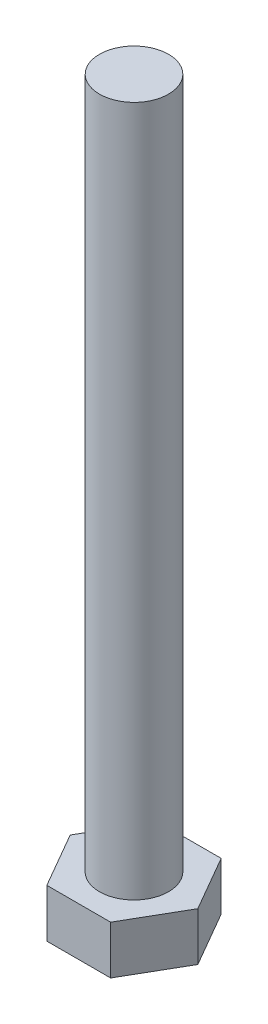
ISO-10303-21;
HEADER;
FILE_DESCRIPTION(('STEP AP214'),'2;1');
FILE_NAME('part.step','',(''),(''),'','','');
FILE_SCHEMA(('AUTOMOTIVE_DESIGN { 1 0 10303 214 1 1 1 1 }'));
ENDSEC;
DATA;
#1=APPLICATION_CONTEXT('core data for automotive mechanical design processes');
#2=APPLICATION_PROTOCOL_DEFINITION('international standard','automotive_design',2000,#1);
#3=PRODUCT_CONTEXT('',#1,'mechanical');
#4=PRODUCT('Part','Part','',(#3));
#5=PRODUCT_RELATED_PRODUCT_CATEGORY('part','',(#4));
#6=PRODUCT_DEFINITION_FORMATION('','',#4);
#7=PRODUCT_DEFINITION_CONTEXT('part definition',#1,'design');
#8=PRODUCT_DEFINITION('design','',#6,#7);
#9=PRODUCT_DEFINITION_SHAPE('','',#8);
#10=(LENGTH_UNIT() NAMED_UNIT(*) SI_UNIT(.MILLI.,.METRE.));
#11=(NAMED_UNIT(*) PLANE_ANGLE_UNIT() SI_UNIT($,.RADIAN.));
#12=(NAMED_UNIT(*) SI_UNIT($,.STERADIAN.) SOLID_ANGLE_UNIT());
#13=UNCERTAINTY_MEASURE_WITH_UNIT(LENGTH_MEASURE(1.E-05),#10,'distance_accuracy_value','');
#14=(GEOMETRIC_REPRESENTATION_CONTEXT(3) GLOBAL_UNCERTAINTY_ASSIGNED_CONTEXT((#13)) GLOBAL_UNIT_ASSIGNED_CONTEXT((#10,
#11,#12)) REPRESENTATION_CONTEXT('',''));
#15=CARTESIAN_POINT('',(0.,0.,0.));
#16=DIRECTION('',(0.,0.,1.));
#17=DIRECTION('',(1.,0.,0.));
#18=AXIS2_PLACEMENT_3D('',#15,#16,#17);
#19=CARTESIAN_POINT('',(0.,3.5,0.));
#20=DIRECTION('',(0.,1.,0.));
#21=DIRECTION('',(0.,0.,1.));
#22=AXIS2_PLACEMENT_3D('',#19,#20,#21);
#23=PLANE('',#22);
#24=DIRECTION('',(0.5,0.,-0.866025403784439));
#25=VECTOR('',#24,1.);
#26=CARTESIAN_POINT('',(2.3094010767585,3.5,4.));
#27=LINE('',#26,#25);
#28=CARTESIAN_POINT('',(2.3094010767585,3.5,4.));
#29=VERTEX_POINT('',#28);
#30=CARTESIAN_POINT('',(4.61880215351701,3.5,0.));
#31=VERTEX_POINT('',#30);
#32=EDGE_CURVE('E130',#29,#31,#27,.T.);
#33=ORIENTED_EDGE('',*,*,#32,.T.);
#34=DIRECTION('',(-0.5,0.,-0.866025403784438));
#35=VECTOR('',#34,1.);
#36=CARTESIAN_POINT('',(4.61880215351701,3.5,0.));
#37=LINE('',#36,#35);
#38=CARTESIAN_POINT('',(2.3094010767585,3.5,-4.));
#39=VERTEX_POINT('',#38);
#40=EDGE_CURVE('E88',#31,#39,#37,.T.);
#41=ORIENTED_EDGE('',*,*,#40,.T.);
#42=DIRECTION('',(-1.,0.,0.));
#43=VECTOR('',#42,1.);
#44=CARTESIAN_POINT('',(2.3094010767585,3.5,-4.));
#45=LINE('',#44,#43);
#46=CARTESIAN_POINT('',(-2.3094010767585,3.5,-4.));
#47=VERTEX_POINT('',#46);
#48=EDGE_CURVE('E101',#39,#47,#45,.T.);
#49=ORIENTED_EDGE('',*,*,#48,.T.);
#50=DIRECTION('',(-0.5,0.,0.866025403784439));
#51=VECTOR('',#50,1.);
#52=CARTESIAN_POINT('',(-2.3094010767585,3.5,-4.));
#53=LINE('',#52,#51);
#54=CARTESIAN_POINT('',(-4.618802153517,3.5,0.));
#55=VERTEX_POINT('',#54);
#56=EDGE_CURVE('E95',#47,#55,#53,.T.);
#57=ORIENTED_EDGE('',*,*,#56,.T.);
#58=DIRECTION('',(0.5,0.,0.866025403784439));
#59=VECTOR('',#58,1.);
#60=CARTESIAN_POINT('',(-4.618802153517,3.5,0.));
#61=LINE('',#60,#59);
#62=CARTESIAN_POINT('',(-2.3094010767585,3.5,4.));
#63=VERTEX_POINT('',#62);
#64=EDGE_CURVE('E99',#55,#63,#61,.T.);
#65=ORIENTED_EDGE('',*,*,#64,.T.);
#66=DIRECTION('',(1.,0.,0.));
#67=VECTOR('',#66,1.);
#68=CARTESIAN_POINT('',(-2.3094010767585,3.5,4.));
#69=LINE('',#68,#67);
#70=EDGE_CURVE('E51',#63,#29,#69,.T.);
#71=ORIENTED_EDGE('',*,*,#70,.T.);
#72=EDGE_LOOP('',(#33,#41,#49,#57,#65,#71));
#73=FACE_BOUND('',#72,.T.);
#74=CARTESIAN_POINT('',(0.,3.5,0.));
#75=DIRECTION('',(0.,1.,0.));
#76=DIRECTION('',(0.,0.,1.));
#77=AXIS2_PLACEMENT_3D('',#74,#75,#76);
#78=CIRCLE('',#77,2.5);
#79=CARTESIAN_POINT('',(0.,3.5,2.5));
#80=VERTEX_POINT('',#79);
#81=EDGE_CURVE('E170',#80,#80,#78,.T.);
#82=ORIENTED_EDGE('',*,*,#81,.F.);
#83=EDGE_LOOP('',(#82));
#84=FACE_BOUND('',#83,.T.);
#85=ADVANCED_FACE('F34',(#73,#84),#23,.T.);
#86=CARTESIAN_POINT('',(2.3094010767585,3.5,4.));
#87=DIRECTION('',(-0.866025403784439,0.,-0.5));
#88=DIRECTION('',(-0.5,0.,0.866025403784439));
#89=AXIS2_PLACEMENT_3D('',#86,#87,#88);
#90=PLANE('',#89);
#91=DIRECTION('',(0.5,0.,-0.866025403784439));
#92=VECTOR('',#91,1.);
#93=CARTESIAN_POINT('',(2.3094010767585,0.,4.));
#94=LINE('',#93,#92);
#95=CARTESIAN_POINT('',(2.3094010767585,0.,4.));
#96=VERTEX_POINT('',#95);
#97=CARTESIAN_POINT('',(4.61880215351701,0.,0.));
#98=VERTEX_POINT('',#97);
#99=EDGE_CURVE('E119',#96,#98,#94,.T.);
#100=ORIENTED_EDGE('',*,*,#99,.T.);
#101=DIRECTION('',(0.,-1.,0.));
#102=VECTOR('',#101,1.);
#103=CARTESIAN_POINT('',(4.61880215351701,3.5,0.));
#104=LINE('',#103,#102);
#105=EDGE_CURVE('E11',#31,#98,#104,.T.);
#106=ORIENTED_EDGE('',*,*,#105,.F.);
#107=ORIENTED_EDGE('',*,*,#32,.F.);
#108=DIRECTION('',(0.,-1.,0.));
#109=VECTOR('',#108,1.);
#110=CARTESIAN_POINT('',(2.3094010767585,3.5,4.));
#111=LINE('',#110,#109);
#112=EDGE_CURVE('E115',#29,#96,#111,.T.);
#113=ORIENTED_EDGE('',*,*,#112,.T.);
#114=EDGE_LOOP('',(#100,#106,#107,#113));
#115=FACE_BOUND('',#114,.T.);
#116=ADVANCED_FACE('F36',(#115),#90,.F.);
#117=CARTESIAN_POINT('',(4.61880215351701,3.5,0.));
#118=DIRECTION('',(-0.866025403784438,0.,0.5));
#119=DIRECTION('',(0.5,0.,0.866025403784439));
#120=AXIS2_PLACEMENT_3D('',#117,#118,#119);
#121=PLANE('',#120);
#122=DIRECTION('',(-0.5,0.,-0.866025403784438));
#123=VECTOR('',#122,1.);
#124=CARTESIAN_POINT('',(4.61880215351701,0.,0.));
#125=LINE('',#124,#123);
#126=CARTESIAN_POINT('',(2.3094010767585,0.,-4.));
#127=VERTEX_POINT('',#126);
#128=EDGE_CURVE('E122',#98,#127,#125,.T.);
#129=ORIENTED_EDGE('',*,*,#128,.T.);
#130=DIRECTION('',(0.,-1.,0.));
#131=VECTOR('',#130,1.);
#132=CARTESIAN_POINT('',(2.3094010767585,3.5,-4.));
#133=LINE('',#132,#131);
#134=EDGE_CURVE('E43',#39,#127,#133,.T.);
#135=ORIENTED_EDGE('',*,*,#134,.F.);
#136=ORIENTED_EDGE('',*,*,#40,.F.);
#137=ORIENTED_EDGE('',*,*,#105,.T.);
#138=EDGE_LOOP('',(#129,#135,#136,#137));
#139=FACE_BOUND('',#138,.T.);
#140=ADVANCED_FACE('F158',(#139),#121,.F.);
#141=CARTESIAN_POINT('',(2.3094010767585,3.5,-4.));
#142=DIRECTION('',(0.,0.,1.));
#143=DIRECTION('',(1.,0.,0.));
#144=AXIS2_PLACEMENT_3D('',#141,#142,#143);
#145=PLANE('',#144);
#146=DIRECTION('',(-1.,0.,0.));
#147=VECTOR('',#146,1.);
#148=CARTESIAN_POINT('',(2.3094010767585,0.,-4.));
#149=LINE('',#148,#147);
#150=CARTESIAN_POINT('',(-2.3094010767585,0.,-4.));
#151=VERTEX_POINT('',#150);
#152=EDGE_CURVE('E125',#127,#151,#149,.T.);
#153=ORIENTED_EDGE('',*,*,#152,.T.);
#154=DIRECTION('',(0.,-1.,0.));
#155=VECTOR('',#154,1.);
#156=CARTESIAN_POINT('',(-2.3094010767585,3.5,-4.));
#157=LINE('',#156,#155);
#158=EDGE_CURVE('E110',#47,#151,#157,.T.);
#159=ORIENTED_EDGE('',*,*,#158,.F.);
#160=ORIENTED_EDGE('',*,*,#48,.F.);
#161=ORIENTED_EDGE('',*,*,#134,.T.);
#162=EDGE_LOOP('',(#153,#159,#160,#161));
#163=FACE_BOUND('',#162,.T.);
#164=ADVANCED_FACE('F136',(#163),#145,.F.);
#165=CARTESIAN_POINT('',(-2.3094010767585,3.5,-4.));
#166=DIRECTION('',(0.866025403784439,0.,0.5));
#167=DIRECTION('',(0.5,0.,-0.866025403784439));
#168=AXIS2_PLACEMENT_3D('',#165,#166,#167);
#169=PLANE('',#168);
#170=DIRECTION('',(-0.5,0.,0.866025403784439));
#171=VECTOR('',#170,1.);
#172=CARTESIAN_POINT('',(-2.3094010767585,0.,-4.));
#173=LINE('',#172,#171);
#174=CARTESIAN_POINT('',(-4.618802153517,0.,0.));
#175=VERTEX_POINT('',#174);
#176=EDGE_CURVE('E109',#151,#175,#173,.T.);
#177=ORIENTED_EDGE('',*,*,#176,.T.);
#178=DIRECTION('',(0.,-1.,0.));
#179=VECTOR('',#178,1.);
#180=CARTESIAN_POINT('',(-4.618802153517,3.5,0.));
#181=LINE('',#180,#179);
#182=EDGE_CURVE('E106',#55,#175,#181,.T.);
#183=ORIENTED_EDGE('',*,*,#182,.F.);
#184=ORIENTED_EDGE('',*,*,#56,.F.);
#185=ORIENTED_EDGE('',*,*,#158,.T.);
#186=EDGE_LOOP('',(#177,#183,#184,#185));
#187=FACE_BOUND('',#186,.T.);
#188=ADVANCED_FACE('F107',(#187),#169,.F.);
#189=CARTESIAN_POINT('',(-4.618802153517,3.5,0.));
#190=DIRECTION('',(0.866025403784439,0.,-0.5));
#191=DIRECTION('',(-0.5,0.,-0.866025403784439));
#192=AXIS2_PLACEMENT_3D('',#189,#190,#191);
#193=PLANE('',#192);
#194=DIRECTION('',(0.5,0.,0.866025403784439));
#195=VECTOR('',#194,1.);
#196=CARTESIAN_POINT('',(-4.618802153517,0.,0.));
#197=LINE('',#196,#195);
#198=CARTESIAN_POINT('',(-2.3094010767585,0.,4.));
#199=VERTEX_POINT('',#198);
#200=EDGE_CURVE('E74',#175,#199,#197,.T.);
#201=ORIENTED_EDGE('',*,*,#200,.T.);
#202=DIRECTION('',(0.,-1.,0.));
#203=VECTOR('',#202,1.);
#204=CARTESIAN_POINT('',(-2.3094010767585,3.5,4.));
#205=LINE('',#204,#203);
#206=EDGE_CURVE('E111',#63,#199,#205,.T.);
#207=ORIENTED_EDGE('',*,*,#206,.F.);
#208=ORIENTED_EDGE('',*,*,#64,.F.);
#209=ORIENTED_EDGE('',*,*,#182,.T.);
#210=EDGE_LOOP('',(#201,#207,#208,#209));
#211=FACE_BOUND('',#210,.T.);
#212=ADVANCED_FACE('F113',(#211),#193,.F.);
#213=CARTESIAN_POINT('',(-2.3094010767585,3.5,4.));
#214=DIRECTION('',(0.,0.,-1.));
#215=DIRECTION('',(-1.,0.,0.));
#216=AXIS2_PLACEMENT_3D('',#213,#214,#215);
#217=PLANE('',#216);
#218=DIRECTION('',(1.,0.,0.));
#219=VECTOR('',#218,1.);
#220=CARTESIAN_POINT('',(-2.3094010767585,0.,4.));
#221=LINE('',#220,#219);
#222=EDGE_CURVE('E80',#199,#96,#221,.T.);
#223=ORIENTED_EDGE('',*,*,#222,.T.);
#224=ORIENTED_EDGE('',*,*,#112,.F.);
#225=ORIENTED_EDGE('',*,*,#70,.F.);
#226=ORIENTED_EDGE('',*,*,#206,.T.);
#227=EDGE_LOOP('',(#223,#224,#225,#226));
#228=FACE_BOUND('',#227,.T.);
#229=ADVANCED_FACE('F143',(#228),#217,.F.);
#230=CARTESIAN_POINT('',(0.,0.,0.));
#231=DIRECTION('',(0.,1.,0.));
#232=DIRECTION('',(0.,0.,1.));
#233=AXIS2_PLACEMENT_3D('',#230,#231,#232);
#234=PLANE('',#233);
#235=ORIENTED_EDGE('',*,*,#99,.F.);
#236=ORIENTED_EDGE('',*,*,#222,.F.);
#237=ORIENTED_EDGE('',*,*,#200,.F.);
#238=ORIENTED_EDGE('',*,*,#176,.F.);
#239=ORIENTED_EDGE('',*,*,#152,.F.);
#240=ORIENTED_EDGE('',*,*,#128,.F.);
#241=EDGE_LOOP('',(#235,#236,#237,#238,#239,#240));
#242=FACE_BOUND('',#241,.T.);
#243=ADVANCED_FACE('F139',(#242),#234,.F.);
#244=CARTESIAN_POINT('',(0.,53.5,0.));
#245=DIRECTION('',(0.,-1.,0.));
#246=DIRECTION('',(0.,0.,-1.));
#247=AXIS2_PLACEMENT_3D('',#244,#245,#246);
#248=CYLINDRICAL_SURFACE('',#247,2.5);
#249=CARTESIAN_POINT('',(0.,53.5,0.));
#250=DIRECTION('',(0.,1.,0.));
#251=DIRECTION('',(0.,0.,1.));
#252=AXIS2_PLACEMENT_3D('',#249,#250,#251);
#253=CIRCLE('',#252,2.5);
#254=CARTESIAN_POINT('',(0.,53.5,2.5));
#255=VERTEX_POINT('',#254);
#256=EDGE_CURVE('E123',#255,#255,#253,.T.);
#257=ORIENTED_EDGE('',*,*,#256,.F.);
#258=EDGE_LOOP('',(#257));
#259=FACE_BOUND('',#258,.T.);
#260=ORIENTED_EDGE('',*,*,#81,.T.);
#261=EDGE_LOOP('',(#260));
#262=FACE_BOUND('',#261,.T.);
#263=ADVANCED_FACE('F150',(#259,#262),#248,.T.);
#264=CARTESIAN_POINT('',(0.,53.5,0.));
#265=DIRECTION('',(0.,1.,0.));
#266=DIRECTION('',(0.,0.,1.));
#267=AXIS2_PLACEMENT_3D('',#264,#265,#266);
#268=PLANE('',#267);
#269=ORIENTED_EDGE('',*,*,#256,.T.);
#270=EDGE_LOOP('',(#269));
#271=FACE_BOUND('',#270,.T.);
#272=ADVANCED_FACE('F162',(#271),#268,.T.);
#273=CLOSED_SHELL('',(#85,#116,#140,#164,#188,#212,#229,#243,#263,#272));
#274=MANIFOLD_SOLID_BREP('B2',#273);
#275=ADVANCED_BREP_SHAPE_REPRESENTATION('',(#18,#274),#14);
#276=SHAPE_DEFINITION_REPRESENTATION(#9,#275);
ENDSEC;
END-ISO-10303-21;
